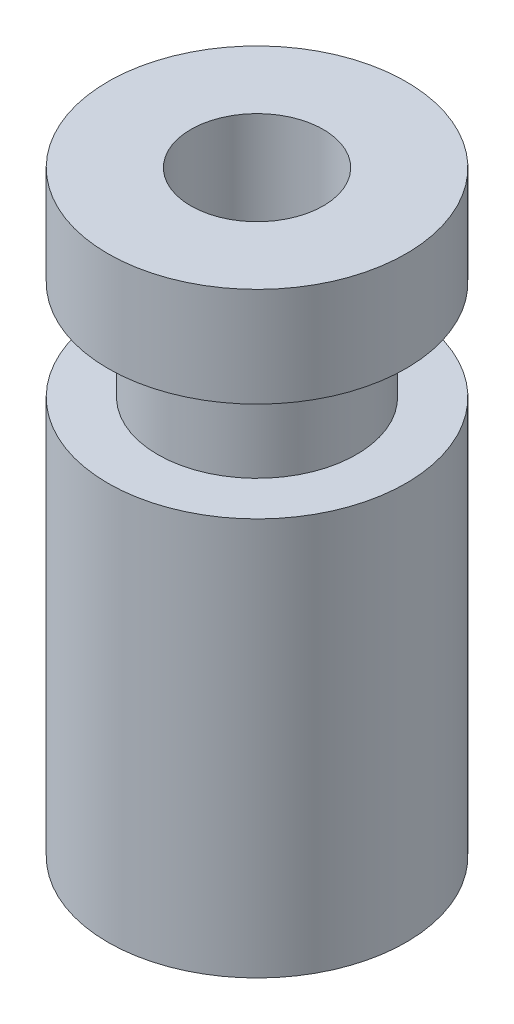
ISO-10303-21;
HEADER;
FILE_DESCRIPTION(('STEP AP214'),'2;1');
FILE_NAME('part.step','',(''),(''),'','','');
FILE_SCHEMA(('AUTOMOTIVE_DESIGN { 1 0 10303 214 1 1 1 1 }'));
ENDSEC;
DATA;
#1=APPLICATION_CONTEXT('core data for automotive mechanical design processes');
#2=APPLICATION_PROTOCOL_DEFINITION('international standard','automotive_design',2000,#1);
#3=PRODUCT_CONTEXT('',#1,'mechanical');
#4=PRODUCT('Part','Part','',(#3));
#5=PRODUCT_RELATED_PRODUCT_CATEGORY('part','',(#4));
#6=PRODUCT_DEFINITION_FORMATION('','',#4);
#7=PRODUCT_DEFINITION_CONTEXT('part definition',#1,'design');
#8=PRODUCT_DEFINITION('design','',#6,#7);
#9=PRODUCT_DEFINITION_SHAPE('','',#8);
#10=(LENGTH_UNIT() NAMED_UNIT(*) SI_UNIT(.MILLI.,.METRE.));
#11=(NAMED_UNIT(*) PLANE_ANGLE_UNIT() SI_UNIT($,.RADIAN.));
#12=(NAMED_UNIT(*) SI_UNIT($,.STERADIAN.) SOLID_ANGLE_UNIT());
#13=UNCERTAINTY_MEASURE_WITH_UNIT(LENGTH_MEASURE(1.E-05),#10,'distance_accuracy_value','');
#14=(GEOMETRIC_REPRESENTATION_CONTEXT(3) GLOBAL_UNCERTAINTY_ASSIGNED_CONTEXT((#13)) GLOBAL_UNIT_ASSIGNED_CONTEXT((#10,
#11,#12)) REPRESENTATION_CONTEXT('',''));
#15=CARTESIAN_POINT('',(0.,0.,0.));
#16=DIRECTION('',(0.,0.,1.));
#17=DIRECTION('',(1.,0.,0.));
#18=AXIS2_PLACEMENT_3D('',#15,#16,#17);
#19=CARTESIAN_POINT('',(0.,6.,0.));
#20=DIRECTION('',(0.,1.,0.));
#21=DIRECTION('',(0.,0.,1.));
#22=AXIS2_PLACEMENT_3D('',#19,#20,#21);
#23=PLANE('',#22);
#24=CARTESIAN_POINT('',(0.,6.,0.));
#25=DIRECTION('',(0.,1.,0.));
#26=DIRECTION('',(0.,0.,1.));
#27=AXIS2_PLACEMENT_3D('',#24,#25,#26);
#28=CIRCLE('',#27,2.25);
#29=CARTESIAN_POINT('',(0.,6.,2.25));
#30=VERTEX_POINT('',#29);
#31=EDGE_CURVE('E10',#30,#30,#28,.T.);
#32=ORIENTED_EDGE('',*,*,#31,.T.);
#33=EDGE_LOOP('',(#32));
#34=FACE_BOUND('',#33,.T.);
#35=CARTESIAN_POINT('',(0.,6.,0.));
#36=DIRECTION('',(0.,1.,0.));
#37=DIRECTION('',(0.,0.,1.));
#38=AXIS2_PLACEMENT_3D('',#35,#36,#37);
#39=CIRCLE('',#38,1.5);
#40=CARTESIAN_POINT('',(0.,6.,1.5));
#41=VERTEX_POINT('',#40);
#42=EDGE_CURVE('E58',#41,#41,#39,.T.);
#43=ORIENTED_EDGE('',*,*,#42,.F.);
#44=EDGE_LOOP('',(#43));
#45=FACE_BOUND('',#44,.T.);
#46=ADVANCED_FACE('F39',(#34,#45),#23,.T.);
#47=CARTESIAN_POINT('',(0.,0.,0.));
#48=DIRECTION('',(0.,1.,0.));
#49=DIRECTION('',(0.,0.,1.));
#50=AXIS2_PLACEMENT_3D('',#47,#48,#49);
#51=PLANE('',#50);
#52=CARTESIAN_POINT('',(0.,0.,0.));
#53=DIRECTION('',(0.,1.,0.));
#54=DIRECTION('',(0.,0.,1.));
#55=AXIS2_PLACEMENT_3D('',#52,#53,#54);
#56=CIRCLE('',#55,2.25);
#57=CARTESIAN_POINT('',(0.,0.,2.25));
#58=VERTEX_POINT('',#57);
#59=EDGE_CURVE('E43',#58,#58,#56,.T.);
#60=ORIENTED_EDGE('',*,*,#59,.F.);
#61=EDGE_LOOP('',(#60));
#62=FACE_BOUND('',#61,.T.);
#63=CARTESIAN_POINT('',(0.,0.,0.));
#64=DIRECTION('',(0.,1.,0.));
#65=DIRECTION('',(0.,0.,1.));
#66=AXIS2_PLACEMENT_3D('',#63,#64,#65);
#67=CIRCLE('',#66,1.);
#68=CARTESIAN_POINT('',(0.,0.,1.));
#69=VERTEX_POINT('',#68);
#70=EDGE_CURVE('E52',#69,#69,#67,.T.);
#71=ORIENTED_EDGE('',*,*,#70,.T.);
#72=EDGE_LOOP('',(#71));
#73=FACE_BOUND('',#72,.T.);
#74=ADVANCED_FACE('F96',(#62,#73),#51,.F.);
#75=CARTESIAN_POINT('',(0.,6.,0.));
#76=DIRECTION('',(0.,-1.,0.));
#77=DIRECTION('',(0.,0.,-1.));
#78=AXIS2_PLACEMENT_3D('',#75,#76,#77);
#79=CYLINDRICAL_SURFACE('',#78,2.25);
#80=ORIENTED_EDGE('',*,*,#31,.F.);
#81=EDGE_LOOP('',(#80));
#82=FACE_BOUND('',#81,.T.);
#83=ORIENTED_EDGE('',*,*,#59,.T.);
#84=EDGE_LOOP('',(#83));
#85=FACE_BOUND('',#84,.T.);
#86=ADVANCED_FACE('F41',(#82,#85),#79,.T.);
#87=CARTESIAN_POINT('',(0.,6.,0.));
#88=DIRECTION('',(0.,-1.,0.));
#89=DIRECTION('',(0.,0.,-1.));
#90=AXIS2_PLACEMENT_3D('',#87,#88,#89);
#91=CYLINDRICAL_SURFACE('',#90,1.);
#92=ORIENTED_EDGE('',*,*,#70,.F.);
#93=EDGE_LOOP('',(#92));
#94=FACE_BOUND('',#93,.T.);
#95=CARTESIAN_POINT('',(0.,9.,0.));
#96=DIRECTION('',(0.,1.,0.));
#97=DIRECTION('',(0.,0.,1.));
#98=AXIS2_PLACEMENT_3D('',#95,#96,#97);
#99=CIRCLE('',#98,1.);
#100=CARTESIAN_POINT('',(0.,9.,1.));
#101=VERTEX_POINT('',#100);
#102=EDGE_CURVE('E70',#101,#101,#99,.T.);
#103=ORIENTED_EDGE('',*,*,#102,.T.);
#104=EDGE_LOOP('',(#103));
#105=FACE_BOUND('',#104,.T.);
#106=ADVANCED_FACE('F78',(#94,#105),#91,.F.);
#107=CARTESIAN_POINT('',(0.,7.5,0.));
#108=DIRECTION('',(0.,-1.,0.));
#109=DIRECTION('',(0.,0.,-1.));
#110=AXIS2_PLACEMENT_3D('',#107,#108,#109);
#111=CYLINDRICAL_SURFACE('',#110,1.5);
#112=CARTESIAN_POINT('',(0.,7.5,0.));
#113=DIRECTION('',(0.,1.,0.));
#114=DIRECTION('',(0.,0.,1.));
#115=AXIS2_PLACEMENT_3D('',#112,#113,#114);
#116=CIRCLE('',#115,1.5);
#117=CARTESIAN_POINT('',(0.,7.5,1.5));
#118=VERTEX_POINT('',#117);
#119=EDGE_CURVE('E57',#118,#118,#116,.T.);
#120=ORIENTED_EDGE('',*,*,#119,.F.);
#121=EDGE_LOOP('',(#120));
#122=FACE_BOUND('',#121,.T.);
#123=ORIENTED_EDGE('',*,*,#42,.T.);
#124=EDGE_LOOP('',(#123));
#125=FACE_BOUND('',#124,.T.);
#126=ADVANCED_FACE('F83',(#122,#125),#111,.T.);
#127=CARTESIAN_POINT('',(0.,9.,0.));
#128=DIRECTION('',(0.,1.,0.));
#129=DIRECTION('',(0.,0.,1.));
#130=AXIS2_PLACEMENT_3D('',#127,#128,#129);
#131=PLANE('',#130);
#132=CARTESIAN_POINT('',(0.,9.,0.));
#133=DIRECTION('',(0.,1.,0.));
#134=DIRECTION('',(0.,0.,1.));
#135=AXIS2_PLACEMENT_3D('',#132,#133,#134);
#136=CIRCLE('',#135,2.25);
#137=CARTESIAN_POINT('',(0.,9.,2.25));
#138=VERTEX_POINT('',#137);
#139=EDGE_CURVE('E62',#138,#138,#136,.T.);
#140=ORIENTED_EDGE('',*,*,#139,.T.);
#141=EDGE_LOOP('',(#140));
#142=FACE_BOUND('',#141,.T.);
#143=ORIENTED_EDGE('',*,*,#102,.F.);
#144=EDGE_LOOP('',(#143));
#145=FACE_BOUND('',#144,.T.);
#146=ADVANCED_FACE('F80',(#142,#145),#131,.T.);
#147=CARTESIAN_POINT('',(0.,7.5,0.));
#148=DIRECTION('',(0.,1.,0.));
#149=DIRECTION('',(0.,0.,1.));
#150=AXIS2_PLACEMENT_3D('',#147,#148,#149);
#151=PLANE('',#150);
#152=ORIENTED_EDGE('',*,*,#119,.T.);
#153=EDGE_LOOP('',(#152));
#154=FACE_BOUND('',#153,.T.);
#155=CARTESIAN_POINT('',(0.,7.5,0.));
#156=DIRECTION('',(0.,1.,0.));
#157=DIRECTION('',(0.,0.,1.));
#158=AXIS2_PLACEMENT_3D('',#155,#156,#157);
#159=CIRCLE('',#158,2.25);
#160=CARTESIAN_POINT('',(0.,7.5,2.25));
#161=VERTEX_POINT('',#160);
#162=EDGE_CURVE('E66',#161,#161,#159,.T.);
#163=ORIENTED_EDGE('',*,*,#162,.F.);
#164=EDGE_LOOP('',(#163));
#165=FACE_BOUND('',#164,.T.);
#166=ADVANCED_FACE('F82',(#154,#165),#151,.F.);
#167=CARTESIAN_POINT('',(0.,9.,0.));
#168=DIRECTION('',(0.,-1.,0.));
#169=DIRECTION('',(0.,0.,-1.));
#170=AXIS2_PLACEMENT_3D('',#167,#168,#169);
#171=CYLINDRICAL_SURFACE('',#170,2.25);
#172=ORIENTED_EDGE('',*,*,#139,.F.);
#173=EDGE_LOOP('',(#172));
#174=FACE_BOUND('',#173,.T.);
#175=ORIENTED_EDGE('',*,*,#162,.T.);
#176=EDGE_LOOP('',(#175));
#177=FACE_BOUND('',#176,.T.);
#178=ADVANCED_FACE('F90',(#174,#177),#171,.T.);
#179=CLOSED_SHELL('',(#46,#74,#86,#106,#126,#146,#166,#178));
#180=MANIFOLD_SOLID_BREP('B2',#179);
#181=ADVANCED_BREP_SHAPE_REPRESENTATION('',(#18,#180),#14);
#182=SHAPE_DEFINITION_REPRESENTATION(#9,#181);
ENDSEC;
END-ISO-10303-21;
